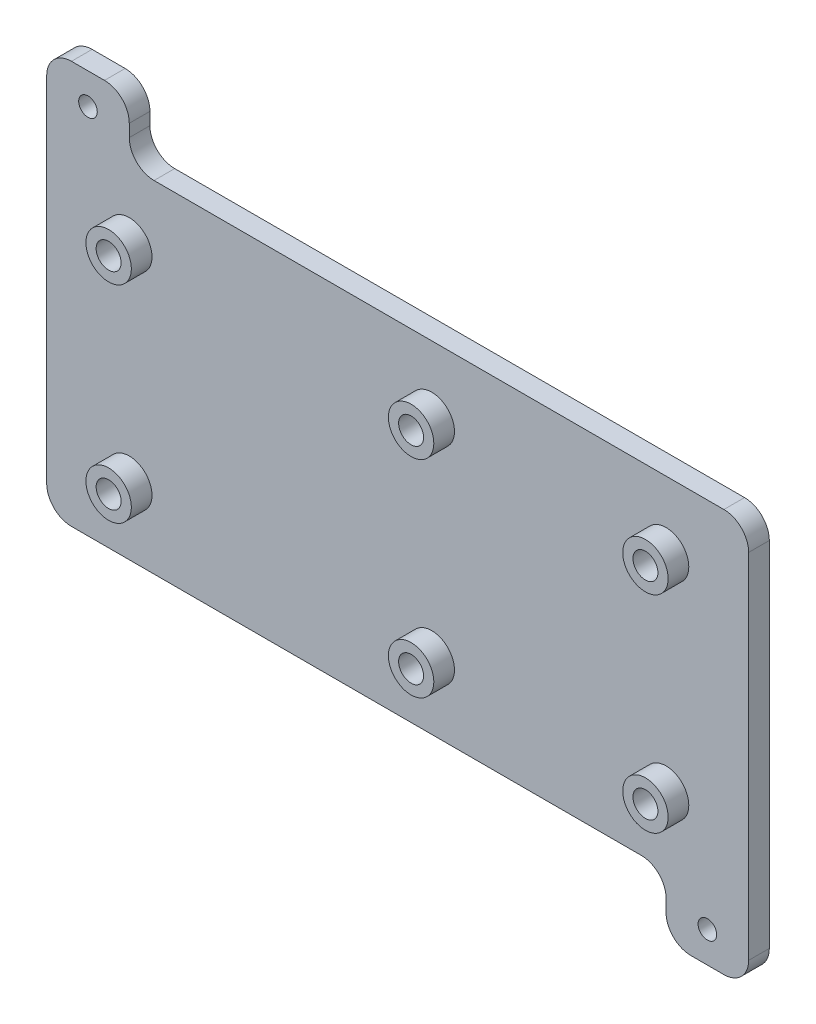
ISO-10303-21;
HEADER;
FILE_DESCRIPTION(('STEP AP214'),'2;1');
FILE_NAME('part.step','',(''),(''),'','','');
FILE_SCHEMA(('AUTOMOTIVE_DESIGN { 1 0 10303 214 1 1 1 1 }'));
ENDSEC;
DATA;
#1=APPLICATION_CONTEXT('core data for automotive mechanical design processes');
#2=APPLICATION_PROTOCOL_DEFINITION('international standard','automotive_design',2000,#1);
#3=PRODUCT_CONTEXT('',#1,'mechanical');
#4=PRODUCT('Part','Part','',(#3));
#5=PRODUCT_RELATED_PRODUCT_CATEGORY('part','',(#4));
#6=PRODUCT_DEFINITION_FORMATION('','',#4);
#7=PRODUCT_DEFINITION_CONTEXT('part definition',#1,'design');
#8=PRODUCT_DEFINITION('design','',#6,#7);
#9=PRODUCT_DEFINITION_SHAPE('','',#8);
#10=(LENGTH_UNIT() NAMED_UNIT(*) SI_UNIT(.MILLI.,.METRE.));
#11=(NAMED_UNIT(*) PLANE_ANGLE_UNIT() SI_UNIT($,.RADIAN.));
#12=(NAMED_UNIT(*) SI_UNIT($,.STERADIAN.) SOLID_ANGLE_UNIT());
#13=UNCERTAINTY_MEASURE_WITH_UNIT(LENGTH_MEASURE(1.E-05),#10,'distance_accuracy_value','');
#14=(GEOMETRIC_REPRESENTATION_CONTEXT(3) GLOBAL_UNCERTAINTY_ASSIGNED_CONTEXT((#13)) GLOBAL_UNIT_ASSIGNED_CONTEXT((#10,
#11,#12)) REPRESENTATION_CONTEXT('',''));
#15=CARTESIAN_POINT('',(0.,0.,0.));
#16=DIRECTION('',(0.,0.,1.));
#17=DIRECTION('',(1.,0.,0.));
#18=AXIS2_PLACEMENT_3D('',#15,#16,#17);
#19=CARTESIAN_POINT('',(85.,41.275,5.));
#20=DIRECTION('',(-1.,0.,0.));
#21=DIRECTION('',(0.,-1.,0.));
#22=AXIS2_PLACEMENT_3D('',#19,#20,#21);
#23=PLANE('',#22);
#24=DIRECTION('',(0.,1.,0.));
#25=VECTOR('',#24,1.);
#26=CARTESIAN_POINT('',(85.,41.275,5.));
#27=LINE('',#26,#25);
#28=CARTESIAN_POINT('',(85.,-50.275,5.));
#29=VERTEX_POINT('',#28);
#30=CARTESIAN_POINT('',(85.,35.275,5.));
#31=VERTEX_POINT('',#30);
#32=EDGE_CURVE('E179',#29,#31,#27,.T.);
#33=ORIENTED_EDGE('',*,*,#32,.F.);
#34=DIRECTION('',(0.,0.,1.));
#35=VECTOR('',#34,1.);
#36=CARTESIAN_POINT('',(85.,-50.275,5.));
#37=LINE('',#36,#35);
#38=CARTESIAN_POINT('',(85.,-50.275,0.));
#39=VERTEX_POINT('',#38);
#40=EDGE_CURVE('E238',#29,#39,#37,.F.);
#41=ORIENTED_EDGE('',*,*,#40,.T.);
#42=DIRECTION('',(0.,1.,0.));
#43=VECTOR('',#42,1.);
#44=CARTESIAN_POINT('',(85.,41.275,0.));
#45=LINE('',#44,#43);
#46=CARTESIAN_POINT('',(85.,35.275,0.));
#47=VERTEX_POINT('',#46);
#48=EDGE_CURVE('E281',#39,#47,#45,.T.);
#49=ORIENTED_EDGE('',*,*,#48,.T.);
#50=DIRECTION('',(0.,0.,-1.));
#51=VECTOR('',#50,1.);
#52=CARTESIAN_POINT('',(85.,35.275,5.));
#53=LINE('',#52,#51);
#54=EDGE_CURVE('E236',#47,#31,#53,.F.);
#55=ORIENTED_EDGE('',*,*,#54,.T.);
#56=EDGE_LOOP('',(#33,#41,#49,#55));
#57=FACE_BOUND('',#56,.T.);
#58=ADVANCED_FACE('F37',(#57),#23,.F.);
#59=CARTESIAN_POINT('',(-85.,41.275,5.));
#60=DIRECTION('',(0.,-1.,0.));
#61=DIRECTION('',(0.,0.,-1.));
#62=AXIS2_PLACEMENT_3D('',#59,#60,#61);
#63=PLANE('',#62);
#64=DIRECTION('',(-1.,0.,0.));
#65=VECTOR('',#64,1.);
#66=CARTESIAN_POINT('',(-85.,41.275,5.));
#67=LINE('',#66,#65);
#68=CARTESIAN_POINT('',(79.,41.275,5.));
#69=VERTEX_POINT('',#68);
#70=CARTESIAN_POINT('',(-59.,41.275,5.));
#71=VERTEX_POINT('',#70);
#72=EDGE_CURVE('E183',#69,#71,#67,.T.);
#73=ORIENTED_EDGE('',*,*,#72,.F.);
#74=DIRECTION('',(0.,0.,-1.));
#75=VECTOR('',#74,1.);
#76=CARTESIAN_POINT('',(79.,41.275,5.));
#77=LINE('',#76,#75);
#78=CARTESIAN_POINT('',(79.,41.275,0.));
#79=VERTEX_POINT('',#78);
#80=EDGE_CURVE('E243',#69,#79,#77,.T.);
#81=ORIENTED_EDGE('',*,*,#80,.T.);
#82=DIRECTION('',(-1.,0.,0.));
#83=VECTOR('',#82,1.);
#84=CARTESIAN_POINT('',(-85.,41.275,0.));
#85=LINE('',#84,#83);
#86=CARTESIAN_POINT('',(-59.,41.275,0.));
#87=VERTEX_POINT('',#86);
#88=EDGE_CURVE('E185',#79,#87,#85,.T.);
#89=ORIENTED_EDGE('',*,*,#88,.T.);
#90=DIRECTION('',(0.,0.,1.));
#91=VECTOR('',#90,1.);
#92=CARTESIAN_POINT('',(-59.,41.275,5.));
#93=LINE('',#92,#91);
#94=EDGE_CURVE('E240',#87,#71,#93,.T.);
#95=ORIENTED_EDGE('',*,*,#94,.T.);
#96=EDGE_LOOP('',(#73,#81,#89,#95));
#97=FACE_BOUND('',#96,.T.);
#98=ADVANCED_FACE('F280',(#97),#63,.F.);
#99=CARTESIAN_POINT('',(-85.,41.275,5.));
#100=DIRECTION('',(1.,0.,0.));
#101=DIRECTION('',(0.,1.,0.));
#102=AXIS2_PLACEMENT_3D('',#99,#100,#101);
#103=PLANE('',#102);
#104=DIRECTION('',(0.,-1.,0.));
#105=VECTOR('',#104,1.);
#106=CARTESIAN_POINT('',(-85.,41.275,5.));
#107=LINE('',#106,#105);
#108=CARTESIAN_POINT('',(-85.,50.275,5.));
#109=VERTEX_POINT('',#108);
#110=CARTESIAN_POINT('',(-85.,-35.275,5.));
#111=VERTEX_POINT('',#110);
#112=EDGE_CURVE('E287',#109,#111,#107,.T.);
#113=ORIENTED_EDGE('',*,*,#112,.F.);
#114=DIRECTION('',(0.,0.,1.));
#115=VECTOR('',#114,1.);
#116=CARTESIAN_POINT('',(-85.,50.275,5.));
#117=LINE('',#116,#115);
#118=CARTESIAN_POINT('',(-85.,50.275,0.));
#119=VERTEX_POINT('',#118);
#120=EDGE_CURVE('E256',#109,#119,#117,.F.);
#121=ORIENTED_EDGE('',*,*,#120,.T.);
#122=DIRECTION('',(0.,-1.,0.));
#123=VECTOR('',#122,1.);
#124=CARTESIAN_POINT('',(-85.,41.275,0.));
#125=LINE('',#124,#123);
#126=CARTESIAN_POINT('',(-85.,-35.275,0.));
#127=VERTEX_POINT('',#126);
#128=EDGE_CURVE('E180',#119,#127,#125,.T.);
#129=ORIENTED_EDGE('',*,*,#128,.T.);
#130=DIRECTION('',(0.,0.,-1.));
#131=VECTOR('',#130,1.);
#132=CARTESIAN_POINT('',(-85.,-35.275,5.));
#133=LINE('',#132,#131);
#134=EDGE_CURVE('E155',#127,#111,#133,.F.);
#135=ORIENTED_EDGE('',*,*,#134,.T.);
#136=EDGE_LOOP('',(#113,#121,#129,#135));
#137=FACE_BOUND('',#136,.T.);
#138=ADVANCED_FACE('F415',(#137),#103,.F.);
#139=CARTESIAN_POINT('',(-85.,-41.275,5.));
#140=DIRECTION('',(0.,1.,0.));
#141=DIRECTION('',(0.,0.,1.));
#142=AXIS2_PLACEMENT_3D('',#139,#140,#141);
#143=PLANE('',#142);
#144=DIRECTION('',(1.,0.,0.));
#145=VECTOR('',#144,1.);
#146=CARTESIAN_POINT('',(-85.,-41.275,0.));
#147=LINE('',#146,#145);
#148=CARTESIAN_POINT('',(-79.,-41.275,0.));
#149=VERTEX_POINT('',#148);
#150=CARTESIAN_POINT('',(59.,-41.275,0.));
#151=VERTEX_POINT('',#150);
#152=EDGE_CURVE('E167',#149,#151,#147,.T.);
#153=ORIENTED_EDGE('',*,*,#152,.T.);
#154=DIRECTION('',(0.,0.,1.));
#155=VECTOR('',#154,1.);
#156=CARTESIAN_POINT('',(59.,-41.275,5.));
#157=LINE('',#156,#155);
#158=CARTESIAN_POINT('',(59.,-41.275,5.));
#159=VERTEX_POINT('',#158);
#160=EDGE_CURVE('E171',#151,#159,#157,.T.);
#161=ORIENTED_EDGE('',*,*,#160,.T.);
#162=DIRECTION('',(1.,0.,0.));
#163=VECTOR('',#162,1.);
#164=CARTESIAN_POINT('',(-85.,-41.275,5.));
#165=LINE('',#164,#163);
#166=CARTESIAN_POINT('',(-79.,-41.275,5.));
#167=VERTEX_POINT('',#166);
#168=EDGE_CURVE('E170',#167,#159,#165,.T.);
#169=ORIENTED_EDGE('',*,*,#168,.F.);
#170=DIRECTION('',(0.,0.,-1.));
#171=VECTOR('',#170,1.);
#172=CARTESIAN_POINT('',(-79.,-41.275,5.));
#173=LINE('',#172,#171);
#174=EDGE_CURVE('E154',#167,#149,#173,.T.);
#175=ORIENTED_EDGE('',*,*,#174,.T.);
#176=EDGE_LOOP('',(#153,#161,#169,#175));
#177=FACE_BOUND('',#176,.T.);
#178=ADVANCED_FACE('F165',(#177),#143,.F.);
#179=CARTESIAN_POINT('',(0.,0.,5.));
#180=DIRECTION('',(0.,0.,1.));
#181=DIRECTION('',(1.,0.,0.));
#182=AXIS2_PLACEMENT_3D('',#179,#180,#181);
#183=PLANE('',#182);
#184=CARTESIAN_POINT('',(-75.,48.775,5.));
#185=DIRECTION('',(0.,0.,1.));
#186=DIRECTION('',(1.,0.,0.));
#187=AXIS2_PLACEMENT_3D('',#184,#185,#186);
#188=CIRCLE('',#187,2.24999999999999);
#189=CARTESIAN_POINT('',(-72.75,48.775,5.));
#190=VERTEX_POINT('',#189);
#191=EDGE_CURVE('E369',#190,#190,#188,.T.);
#192=ORIENTED_EDGE('',*,*,#191,.F.);
#193=EDGE_LOOP('',(#192));
#194=FACE_BOUND('',#193,.T.);
#195=CARTESIAN_POINT('',(75.,-48.775,5.));
#196=DIRECTION('',(0.,0.,1.));
#197=DIRECTION('',(1.,0.,0.));
#198=AXIS2_PLACEMENT_3D('',#195,#196,#197);
#199=CIRCLE('',#198,2.24999999999999);
#200=CARTESIAN_POINT('',(77.25,-48.775,5.));
#201=VERTEX_POINT('',#200);
#202=EDGE_CURVE('E363',#201,#201,#199,.T.);
#203=ORIENTED_EDGE('',*,*,#202,.F.);
#204=EDGE_LOOP('',(#203));
#205=FACE_BOUND('',#204,.T.);
#206=CARTESIAN_POINT('',(65.0000000000003,-25.,5.));
#207=DIRECTION('',(0.,0.,1.));
#208=DIRECTION('',(1.,0.,0.));
#209=AXIS2_PLACEMENT_3D('',#206,#207,#208);
#210=CIRCLE('',#209,5.49999999999954);
#211=CARTESIAN_POINT('',(70.4999999999999,-25.,5.));
#212=VERTEX_POINT('',#211);
#213=EDGE_CURVE('E336',#212,#212,#210,.T.);
#214=ORIENTED_EDGE('',*,*,#213,.F.);
#215=EDGE_LOOP('',(#214));
#216=FACE_BOUND('',#215,.T.);
#217=CARTESIAN_POINT('',(8.25000000000034,-25.,5.));
#218=DIRECTION('',(0.,0.,1.));
#219=DIRECTION('',(1.,0.,0.));
#220=AXIS2_PLACEMENT_3D('',#217,#218,#219);
#221=CIRCLE('',#220,5.49999999999953);
#222=CARTESIAN_POINT('',(13.7499999999999,-25.,5.));
#223=VERTEX_POINT('',#222);
#224=EDGE_CURVE('E327',#223,#223,#221,.T.);
#225=ORIENTED_EDGE('',*,*,#224,.F.);
#226=EDGE_LOOP('',(#225));
#227=FACE_BOUND('',#226,.T.);
#228=CARTESIAN_POINT('',(-64.9999999999997,-25.,5.));
#229=DIRECTION('',(0.,0.,1.));
#230=DIRECTION('',(1.,0.,0.));
#231=AXIS2_PLACEMENT_3D('',#228,#229,#230);
#232=CIRCLE('',#231,5.49999999999953);
#233=CARTESIAN_POINT('',(-59.5000000000002,-25.,5.));
#234=VERTEX_POINT('',#233);
#235=EDGE_CURVE('E318',#234,#234,#232,.T.);
#236=ORIENTED_EDGE('',*,*,#235,.F.);
#237=EDGE_LOOP('',(#236));
#238=FACE_BOUND('',#237,.T.);
#239=CARTESIAN_POINT('',(-64.9999999999997,25.,5.));
#240=DIRECTION('',(0.,0.,1.));
#241=DIRECTION('',(1.,0.,0.));
#242=AXIS2_PLACEMENT_3D('',#239,#240,#241);
#243=CIRCLE('',#242,5.49999999999952);
#244=CARTESIAN_POINT('',(-59.5000000000002,25.,5.));
#245=VERTEX_POINT('',#244);
#246=EDGE_CURVE('E309',#245,#245,#243,.T.);
#247=ORIENTED_EDGE('',*,*,#246,.F.);
#248=EDGE_LOOP('',(#247));
#249=FACE_BOUND('',#248,.T.);
#250=CARTESIAN_POINT('',(8.2500000000003,25.,5.));
#251=DIRECTION('',(0.,0.,1.));
#252=DIRECTION('',(1.,0.,0.));
#253=AXIS2_PLACEMENT_3D('',#250,#251,#252);
#254=CIRCLE('',#253,5.49999999999953);
#255=CARTESIAN_POINT('',(13.7499999999998,25.,5.));
#256=VERTEX_POINT('',#255);
#257=EDGE_CURVE('E300',#256,#256,#254,.T.);
#258=ORIENTED_EDGE('',*,*,#257,.F.);
#259=EDGE_LOOP('',(#258));
#260=FACE_BOUND('',#259,.T.);
#261=CARTESIAN_POINT('',(65.0000000000003,25.,5.));
#262=DIRECTION('',(0.,0.,1.));
#263=DIRECTION('',(1.,0.,0.));
#264=AXIS2_PLACEMENT_3D('',#261,#262,#263);
#265=CIRCLE('',#264,5.49999999999954);
#266=CARTESIAN_POINT('',(70.4999999999998,25.,5.));
#267=VERTEX_POINT('',#266);
#268=EDGE_CURVE('E291',#267,#267,#265,.T.);
#269=ORIENTED_EDGE('',*,*,#268,.F.);
#270=EDGE_LOOP('',(#269));
#271=FACE_BOUND('',#270,.T.);
#272=DIRECTION('',(0.,-1.,0.));
#273=VECTOR('',#272,1.);
#274=CARTESIAN_POINT('',(65.,0.,5.));
#275=LINE('',#274,#273);
#276=CARTESIAN_POINT('',(65.,-47.275,5.));
#277=VERTEX_POINT('',#276);
#278=CARTESIAN_POINT('',(65.,-50.275,5.));
#279=VERTEX_POINT('',#278);
#280=EDGE_CURVE('E355',#277,#279,#275,.T.);
#281=ORIENTED_EDGE('',*,*,#280,.T.);
#282=CARTESIAN_POINT('',(71.,-50.275,5.));
#283=DIRECTION('',(0.,0.,1.));
#284=DIRECTION('',(1.,0.,0.));
#285=AXIS2_PLACEMENT_3D('',#282,#283,#284);
#286=CIRCLE('',#285,6.);
#287=CARTESIAN_POINT('',(71.,-56.275,5.));
#288=VERTEX_POINT('',#287);
#289=EDGE_CURVE('E222',#279,#288,#286,.T.);
#290=ORIENTED_EDGE('',*,*,#289,.T.);
#291=DIRECTION('',(-1.,0.,0.));
#292=VECTOR('',#291,1.);
#293=CARTESIAN_POINT('',(0.,-56.275,5.));
#294=LINE('',#293,#292);
#295=CARTESIAN_POINT('',(79.,-56.275,5.));
#296=VERTEX_POINT('',#295);
#297=EDGE_CURVE('E351',#296,#288,#294,.T.);
#298=ORIENTED_EDGE('',*,*,#297,.F.);
#299=CARTESIAN_POINT('',(79.,-50.275,5.));
#300=DIRECTION('',(0.,0.,1.));
#301=DIRECTION('',(1.,0.,0.));
#302=AXIS2_PLACEMENT_3D('',#299,#300,#301);
#303=CIRCLE('',#302,6.);
#304=EDGE_CURVE('E220',#296,#29,#303,.T.);
#305=ORIENTED_EDGE('',*,*,#304,.T.);
#306=ORIENTED_EDGE('',*,*,#32,.T.);
#307=CARTESIAN_POINT('',(79.,35.275,5.));
#308=DIRECTION('',(0.,0.,1.));
#309=DIRECTION('',(1.,0.,0.));
#310=AXIS2_PLACEMENT_3D('',#307,#308,#309);
#311=CIRCLE('',#310,6.);
#312=EDGE_CURVE('E218',#31,#69,#311,.T.);
#313=ORIENTED_EDGE('',*,*,#312,.T.);
#314=ORIENTED_EDGE('',*,*,#72,.T.);
#315=CARTESIAN_POINT('',(-59.,47.275,5.));
#316=DIRECTION('',(0.,0.,1.));
#317=DIRECTION('',(1.,0.,0.));
#318=AXIS2_PLACEMENT_3D('',#315,#316,#317);
#319=CIRCLE('',#318,6.);
#320=CARTESIAN_POINT('',(-65.,47.275,5.));
#321=VERTEX_POINT('',#320);
#322=EDGE_CURVE('E45',#71,#321,#319,.F.);
#323=ORIENTED_EDGE('',*,*,#322,.T.);
#324=DIRECTION('',(0.,1.,0.));
#325=VECTOR('',#324,1.);
#326=CARTESIAN_POINT('',(-65.,0.,5.));
#327=LINE('',#326,#325);
#328=CARTESIAN_POINT('',(-65.,50.275,5.));
#329=VERTEX_POINT('',#328);
#330=EDGE_CURVE('E266',#321,#329,#327,.T.);
#331=ORIENTED_EDGE('',*,*,#330,.T.);
#332=CARTESIAN_POINT('',(-71.,50.275,5.));
#333=DIRECTION('',(0.,0.,1.));
#334=DIRECTION('',(1.,0.,0.));
#335=AXIS2_PLACEMENT_3D('',#332,#333,#334);
#336=CIRCLE('',#335,6.);
#337=CARTESIAN_POINT('',(-71.,56.275,5.));
#338=VERTEX_POINT('',#337);
#339=EDGE_CURVE('E216',#329,#338,#336,.T.);
#340=ORIENTED_EDGE('',*,*,#339,.T.);
#341=DIRECTION('',(1.,0.,0.));
#342=VECTOR('',#341,1.);
#343=CARTESIAN_POINT('',(0.,56.275,5.));
#344=LINE('',#343,#342);
#345=CARTESIAN_POINT('',(-79.,56.275,5.));
#346=VERTEX_POINT('',#345);
#347=EDGE_CURVE('E275',#346,#338,#344,.T.);
#348=ORIENTED_EDGE('',*,*,#347,.F.);
#349=CARTESIAN_POINT('',(-79.,50.275,5.));
#350=DIRECTION('',(0.,0.,1.));
#351=DIRECTION('',(1.,0.,0.));
#352=AXIS2_PLACEMENT_3D('',#349,#350,#351);
#353=CIRCLE('',#352,6.);
#354=EDGE_CURVE('E214',#346,#109,#353,.T.);
#355=ORIENTED_EDGE('',*,*,#354,.T.);
#356=ORIENTED_EDGE('',*,*,#112,.T.);
#357=CARTESIAN_POINT('',(-79.,-35.275,5.));
#358=DIRECTION('',(0.,0.,1.));
#359=DIRECTION('',(1.,0.,0.));
#360=AXIS2_PLACEMENT_3D('',#357,#358,#359);
#361=CIRCLE('',#360,6.);
#362=EDGE_CURVE('E212',#111,#167,#361,.T.);
#363=ORIENTED_EDGE('',*,*,#362,.T.);
#364=ORIENTED_EDGE('',*,*,#168,.T.);
#365=CARTESIAN_POINT('',(59.,-47.275,5.));
#366=DIRECTION('',(0.,0.,1.));
#367=DIRECTION('',(1.,0.,0.));
#368=AXIS2_PLACEMENT_3D('',#365,#366,#367);
#369=CIRCLE('',#368,6.);
#370=EDGE_CURVE('E258',#159,#277,#369,.F.);
#371=ORIENTED_EDGE('',*,*,#370,.T.);
#372=EDGE_LOOP('',(#281,#290,#298,#305,#306,#313,#314,#323,#331,#340,#348,#355,#356,#363,#364,#371));
#373=FACE_BOUND('',#372,.T.);
#374=ADVANCED_FACE('F265',(#194,#205,#216,#227,#238,#249,#260,#271,#373),#183,.T.);
#375=CARTESIAN_POINT('',(0.,0.,0.));
#376=DIRECTION('',(0.,0.,1.));
#377=DIRECTION('',(1.,0.,0.));
#378=AXIS2_PLACEMENT_3D('',#375,#376,#377);
#379=PLANE('',#378);
#380=CARTESIAN_POINT('',(-75.,48.775,0.));
#381=DIRECTION('',(0.,0.,1.));
#382=DIRECTION('',(1.,0.,0.));
#383=AXIS2_PLACEMENT_3D('',#380,#381,#382);
#384=CIRCLE('',#383,2.24999999999999);
#385=CARTESIAN_POINT('',(-72.75,48.775,0.));
#386=VERTEX_POINT('',#385);
#387=EDGE_CURVE('E366',#386,#386,#384,.T.);
#388=ORIENTED_EDGE('',*,*,#387,.T.);
#389=EDGE_LOOP('',(#388));
#390=FACE_BOUND('',#389,.T.);
#391=CARTESIAN_POINT('',(75.,-48.775,0.));
#392=DIRECTION('',(0.,0.,1.));
#393=DIRECTION('',(1.,0.,0.));
#394=AXIS2_PLACEMENT_3D('',#391,#392,#393);
#395=CIRCLE('',#394,2.24999999999999);
#396=CARTESIAN_POINT('',(77.25,-48.775,0.));
#397=VERTEX_POINT('',#396);
#398=EDGE_CURVE('E357',#397,#397,#395,.T.);
#399=ORIENTED_EDGE('',*,*,#398,.T.);
#400=EDGE_LOOP('',(#399));
#401=FACE_BOUND('',#400,.T.);
#402=DIRECTION('',(-1.,0.,0.));
#403=VECTOR('',#402,1.);
#404=CARTESIAN_POINT('',(0.,-56.275,0.));
#405=LINE('',#404,#403);
#406=CARTESIAN_POINT('',(79.,-56.275,0.));
#407=VERTEX_POINT('',#406);
#408=CARTESIAN_POINT('',(71.,-56.275,0.));
#409=VERTEX_POINT('',#408);
#410=EDGE_CURVE('E276',#407,#409,#405,.T.);
#411=ORIENTED_EDGE('',*,*,#410,.T.);
#412=CARTESIAN_POINT('',(71.,-50.275,0.));
#413=DIRECTION('',(0.,0.,1.));
#414=DIRECTION('',(1.,0.,0.));
#415=AXIS2_PLACEMENT_3D('',#412,#413,#414);
#416=CIRCLE('',#415,6.);
#417=CARTESIAN_POINT('',(65.,-50.275,0.));
#418=VERTEX_POINT('',#417);
#419=EDGE_CURVE('E234',#409,#418,#416,.F.);
#420=ORIENTED_EDGE('',*,*,#419,.T.);
#421=DIRECTION('',(0.,-1.,0.));
#422=VECTOR('',#421,1.);
#423=CARTESIAN_POINT('',(65.,0.,0.));
#424=LINE('',#423,#422);
#425=CARTESIAN_POINT('',(65.,-47.275,0.));
#426=VERTEX_POINT('',#425);
#427=EDGE_CURVE('E354',#426,#418,#424,.T.);
#428=ORIENTED_EDGE('',*,*,#427,.F.);
#429=CARTESIAN_POINT('',(59.,-47.275,0.));
#430=DIRECTION('',(0.,0.,1.));
#431=DIRECTION('',(1.,0.,0.));
#432=AXIS2_PLACEMENT_3D('',#429,#430,#431);
#433=CIRCLE('',#432,6.);
#434=EDGE_CURVE('E178',#426,#151,#433,.T.);
#435=ORIENTED_EDGE('',*,*,#434,.T.);
#436=ORIENTED_EDGE('',*,*,#152,.F.);
#437=CARTESIAN_POINT('',(-79.,-35.275,0.));
#438=DIRECTION('',(0.,0.,1.));
#439=DIRECTION('',(1.,0.,0.));
#440=AXIS2_PLACEMENT_3D('',#437,#438,#439);
#441=CIRCLE('',#440,6.);
#442=EDGE_CURVE('E151',#149,#127,#441,.F.);
#443=ORIENTED_EDGE('',*,*,#442,.T.);
#444=ORIENTED_EDGE('',*,*,#128,.F.);
#445=CARTESIAN_POINT('',(-79.,50.275,0.));
#446=DIRECTION('',(0.,0.,1.));
#447=DIRECTION('',(1.,0.,0.));
#448=AXIS2_PLACEMENT_3D('',#445,#446,#447);
#449=CIRCLE('',#448,6.);
#450=CARTESIAN_POINT('',(-79.,56.275,0.));
#451=VERTEX_POINT('',#450);
#452=EDGE_CURVE('E159',#119,#451,#449,.F.);
#453=ORIENTED_EDGE('',*,*,#452,.T.);
#454=DIRECTION('',(1.,0.,0.));
#455=VECTOR('',#454,1.);
#456=CARTESIAN_POINT('',(0.,56.275,0.));
#457=LINE('',#456,#455);
#458=CARTESIAN_POINT('',(-71.,56.275,0.));
#459=VERTEX_POINT('',#458);
#460=EDGE_CURVE('E344',#451,#459,#457,.T.);
#461=ORIENTED_EDGE('',*,*,#460,.T.);
#462=CARTESIAN_POINT('',(-71.,50.275,0.));
#463=DIRECTION('',(0.,0.,1.));
#464=DIRECTION('',(1.,0.,0.));
#465=AXIS2_PLACEMENT_3D('',#462,#463,#464);
#466=CIRCLE('',#465,6.);
#467=CARTESIAN_POINT('',(-65.,50.275,0.));
#468=VERTEX_POINT('',#467);
#469=EDGE_CURVE('E229',#459,#468,#466,.F.);
#470=ORIENTED_EDGE('',*,*,#469,.T.);
#471=DIRECTION('',(0.,1.,0.));
#472=VECTOR('',#471,1.);
#473=CARTESIAN_POINT('',(-65.,0.,0.));
#474=LINE('',#473,#472);
#475=CARTESIAN_POINT('',(-65.,47.275,0.));
#476=VERTEX_POINT('',#475);
#477=EDGE_CURVE('E346',#476,#468,#474,.T.);
#478=ORIENTED_EDGE('',*,*,#477,.F.);
#479=CARTESIAN_POINT('',(-59.,47.275,0.));
#480=DIRECTION('',(0.,0.,1.));
#481=DIRECTION('',(1.,0.,0.));
#482=AXIS2_PLACEMENT_3D('',#479,#480,#481);
#483=CIRCLE('',#482,6.);
#484=EDGE_CURVE('E11',#476,#87,#483,.T.);
#485=ORIENTED_EDGE('',*,*,#484,.T.);
#486=ORIENTED_EDGE('',*,*,#88,.F.);
#487=CARTESIAN_POINT('',(79.,35.275,0.));
#488=DIRECTION('',(0.,0.,1.));
#489=DIRECTION('',(1.,0.,0.));
#490=AXIS2_PLACEMENT_3D('',#487,#488,#489);
#491=CIRCLE('',#490,6.);
#492=EDGE_CURVE('E58',#79,#47,#491,.F.);
#493=ORIENTED_EDGE('',*,*,#492,.T.);
#494=ORIENTED_EDGE('',*,*,#48,.F.);
#495=CARTESIAN_POINT('',(79.,-50.275,0.));
#496=DIRECTION('',(0.,0.,1.));
#497=DIRECTION('',(1.,0.,0.));
#498=AXIS2_PLACEMENT_3D('',#495,#496,#497);
#499=CIRCLE('',#498,6.);
#500=EDGE_CURVE('E232',#39,#407,#499,.F.);
#501=ORIENTED_EDGE('',*,*,#500,.T.);
#502=EDGE_LOOP('',(#411,#420,#428,#435,#436,#443,#444,#453,#461,#470,#478,#485,#486,#493,#494,#501));
#503=FACE_BOUND('',#502,.T.);
#504=ADVANCED_FACE('F175',(#390,#401,#503),#379,.F.);
#505=CARTESIAN_POINT('',(65.0000000000003,25.,10.));
#506=DIRECTION('',(0.,0.,1.));
#507=DIRECTION('',(1.,0.,0.));
#508=AXIS2_PLACEMENT_3D('',#505,#506,#507);
#509=PLANE('',#508);
#510=CARTESIAN_POINT('',(65.0000000000003,25.,10.));
#511=DIRECTION('',(0.,0.,1.));
#512=DIRECTION('',(1.,0.,0.));
#513=AXIS2_PLACEMENT_3D('',#510,#511,#512);
#514=CIRCLE('',#513,5.49999999999954);
#515=CARTESIAN_POINT('',(70.4999999999998,25.,10.));
#516=VERTEX_POINT('',#515);
#517=EDGE_CURVE('E283',#516,#516,#514,.T.);
#518=ORIENTED_EDGE('',*,*,#517,.T.);
#519=EDGE_LOOP('',(#518));
#520=FACE_BOUND('',#519,.T.);
#521=CARTESIAN_POINT('',(65.0000000000003,25.,10.));
#522=DIRECTION('',(0.,0.,1.));
#523=DIRECTION('',(1.,0.,0.));
#524=AXIS2_PLACEMENT_3D('',#521,#522,#523);
#525=CIRCLE('',#524,3.02499999999954);
#526=CARTESIAN_POINT('',(68.0249999999998,25.,10.));
#527=VERTEX_POINT('',#526);
#528=EDGE_CURVE('E294',#527,#527,#525,.T.);
#529=ORIENTED_EDGE('',*,*,#528,.F.);
#530=EDGE_LOOP('',(#529));
#531=FACE_BOUND('',#530,.T.);
#532=ADVANCED_FACE('F397',(#520,#531),#509,.T.);
#533=CARTESIAN_POINT('',(65.0000000000003,25.,10.));
#534=DIRECTION('',(0.,0.,-1.));
#535=DIRECTION('',(-1.,0.,0.));
#536=AXIS2_PLACEMENT_3D('',#533,#534,#535);
#537=CYLINDRICAL_SURFACE('',#536,5.49999999999954);
#538=ORIENTED_EDGE('',*,*,#517,.F.);
#539=EDGE_LOOP('',(#538));
#540=FACE_BOUND('',#539,.T.);
#541=ORIENTED_EDGE('',*,*,#268,.T.);
#542=EDGE_LOOP('',(#541));
#543=FACE_BOUND('',#542,.T.);
#544=ADVANCED_FACE('F394',(#540,#543),#537,.T.);
#545=CARTESIAN_POINT('',(65.0000000000003,25.,10.));
#546=DIRECTION('',(0.,0.,-1.));
#547=DIRECTION('',(-1.,0.,0.));
#548=AXIS2_PLACEMENT_3D('',#545,#546,#547);
#549=CYLINDRICAL_SURFACE('',#548,3.02499999999954);
#550=ORIENTED_EDGE('',*,*,#528,.T.);
#551=EDGE_LOOP('',(#550));
#552=FACE_BOUND('',#551,.T.);
#553=CARTESIAN_POINT('',(65.0000000000003,25.,5.));
#554=DIRECTION('',(0.,0.,1.));
#555=DIRECTION('',(1.,0.,0.));
#556=AXIS2_PLACEMENT_3D('',#553,#554,#555);
#557=CIRCLE('',#556,3.02499999999954);
#558=CARTESIAN_POINT('',(68.0249999999998,25.,5.));
#559=VERTEX_POINT('',#558);
#560=EDGE_CURVE('E189',#559,#559,#557,.F.);
#561=ORIENTED_EDGE('',*,*,#560,.T.);
#562=EDGE_LOOP('',(#561));
#563=FACE_BOUND('',#562,.T.);
#564=ADVANCED_FACE('F396',(#552,#563),#549,.F.);
#565=ORIENTED_EDGE('',*,*,#560,.F.);
#566=EDGE_LOOP('',(#565));
#567=FACE_BOUND('',#566,.T.);
#568=ADVANCED_FACE('F379',(#567),#183,.T.);
#569=CARTESIAN_POINT('',(8.2500000000003,25.,10.));
#570=DIRECTION('',(0.,0.,1.));
#571=DIRECTION('',(1.,0.,0.));
#572=AXIS2_PLACEMENT_3D('',#569,#570,#571);
#573=PLANE('',#572);
#574=CARTESIAN_POINT('',(8.2500000000003,25.,10.));
#575=DIRECTION('',(0.,0.,1.));
#576=DIRECTION('',(1.,0.,0.));
#577=AXIS2_PLACEMENT_3D('',#574,#575,#576);
#578=CIRCLE('',#577,5.49999999999953);
#579=CARTESIAN_POINT('',(13.7499999999998,25.,10.));
#580=VERTEX_POINT('',#579);
#581=EDGE_CURVE('E299',#580,#580,#578,.T.);
#582=ORIENTED_EDGE('',*,*,#581,.T.);
#583=EDGE_LOOP('',(#582));
#584=FACE_BOUND('',#583,.T.);
#585=CARTESIAN_POINT('',(8.2500000000003,25.,10.));
#586=DIRECTION('',(0.,0.,1.));
#587=DIRECTION('',(1.,0.,0.));
#588=AXIS2_PLACEMENT_3D('',#585,#586,#587);
#589=CIRCLE('',#588,3.02499999999953);
#590=CARTESIAN_POINT('',(11.2749999999998,25.,10.));
#591=VERTEX_POINT('',#590);
#592=EDGE_CURVE('E303',#591,#591,#589,.T.);
#593=ORIENTED_EDGE('',*,*,#592,.F.);
#594=EDGE_LOOP('',(#593));
#595=FACE_BOUND('',#594,.T.);
#596=ADVANCED_FACE('F550',(#584,#595),#573,.T.);
#597=CARTESIAN_POINT('',(8.2500000000003,25.,10.));
#598=DIRECTION('',(0.,0.,-1.));
#599=DIRECTION('',(-1.,0.,0.));
#600=AXIS2_PLACEMENT_3D('',#597,#598,#599);
#601=CYLINDRICAL_SURFACE('',#600,5.49999999999953);
#602=ORIENTED_EDGE('',*,*,#581,.F.);
#603=EDGE_LOOP('',(#602));
#604=FACE_BOUND('',#603,.T.);
#605=ORIENTED_EDGE('',*,*,#257,.T.);
#606=EDGE_LOOP('',(#605));
#607=FACE_BOUND('',#606,.T.);
#608=ADVANCED_FACE('F548',(#604,#607),#601,.T.);
#609=CARTESIAN_POINT('',(8.2500000000003,25.,10.));
#610=DIRECTION('',(0.,0.,-1.));
#611=DIRECTION('',(-1.,0.,0.));
#612=AXIS2_PLACEMENT_3D('',#609,#610,#611);
#613=CYLINDRICAL_SURFACE('',#612,3.02499999999953);
#614=ORIENTED_EDGE('',*,*,#592,.T.);
#615=EDGE_LOOP('',(#614));
#616=FACE_BOUND('',#615,.T.);
#617=CARTESIAN_POINT('',(8.2500000000003,25.,5.));
#618=DIRECTION('',(0.,0.,1.));
#619=DIRECTION('',(1.,0.,0.));
#620=AXIS2_PLACEMENT_3D('',#617,#618,#619);
#621=CIRCLE('',#620,3.02499999999953);
#622=CARTESIAN_POINT('',(11.2749999999998,25.,5.));
#623=VERTEX_POINT('',#622);
#624=EDGE_CURVE('E192',#623,#623,#621,.F.);
#625=ORIENTED_EDGE('',*,*,#624,.T.);
#626=EDGE_LOOP('',(#625));
#627=FACE_BOUND('',#626,.T.);
#628=ADVANCED_FACE('F545',(#616,#627),#613,.F.);
#629=ORIENTED_EDGE('',*,*,#624,.F.);
#630=EDGE_LOOP('',(#629));
#631=FACE_BOUND('',#630,.T.);
#632=ADVANCED_FACE('F540',(#631),#183,.T.);
#633=CARTESIAN_POINT('',(-64.9999999999997,25.,10.));
#634=DIRECTION('',(0.,0.,1.));
#635=DIRECTION('',(1.,0.,0.));
#636=AXIS2_PLACEMENT_3D('',#633,#634,#635);
#637=PLANE('',#636);
#638=CARTESIAN_POINT('',(-64.9999999999997,25.,10.));
#639=DIRECTION('',(0.,0.,1.));
#640=DIRECTION('',(1.,0.,0.));
#641=AXIS2_PLACEMENT_3D('',#638,#639,#640);
#642=CIRCLE('',#641,5.49999999999952);
#643=CARTESIAN_POINT('',(-59.5000000000002,25.,10.));
#644=VERTEX_POINT('',#643);
#645=EDGE_CURVE('E308',#644,#644,#642,.T.);
#646=ORIENTED_EDGE('',*,*,#645,.T.);
#647=EDGE_LOOP('',(#646));
#648=FACE_BOUND('',#647,.T.);
#649=CARTESIAN_POINT('',(-64.9999999999997,25.,10.));
#650=DIRECTION('',(0.,0.,1.));
#651=DIRECTION('',(1.,0.,0.));
#652=AXIS2_PLACEMENT_3D('',#649,#650,#651);
#653=CIRCLE('',#652,3.02499999999953);
#654=CARTESIAN_POINT('',(-61.9750000000002,25.,10.));
#655=VERTEX_POINT('',#654);
#656=EDGE_CURVE('E312',#655,#655,#653,.T.);
#657=ORIENTED_EDGE('',*,*,#656,.F.);
#658=EDGE_LOOP('',(#657));
#659=FACE_BOUND('',#658,.T.);
#660=ADVANCED_FACE('F537',(#648,#659),#637,.T.);
#661=CARTESIAN_POINT('',(-64.9999999999997,25.,10.));
#662=DIRECTION('',(0.,0.,-1.));
#663=DIRECTION('',(-1.,0.,0.));
#664=AXIS2_PLACEMENT_3D('',#661,#662,#663);
#665=CYLINDRICAL_SURFACE('',#664,5.49999999999952);
#666=ORIENTED_EDGE('',*,*,#645,.F.);
#667=EDGE_LOOP('',(#666));
#668=FACE_BOUND('',#667,.T.);
#669=ORIENTED_EDGE('',*,*,#246,.T.);
#670=EDGE_LOOP('',(#669));
#671=FACE_BOUND('',#670,.T.);
#672=ADVANCED_FACE('F535',(#668,#671),#665,.T.);
#673=CARTESIAN_POINT('',(-64.9999999999997,25.,10.));
#674=DIRECTION('',(0.,0.,-1.));
#675=DIRECTION('',(-1.,0.,0.));
#676=AXIS2_PLACEMENT_3D('',#673,#674,#675);
#677=CYLINDRICAL_SURFACE('',#676,3.02499999999953);
#678=ORIENTED_EDGE('',*,*,#656,.T.);
#679=EDGE_LOOP('',(#678));
#680=FACE_BOUND('',#679,.T.);
#681=CARTESIAN_POINT('',(-64.9999999999997,25.,5.));
#682=DIRECTION('',(0.,0.,1.));
#683=DIRECTION('',(1.,0.,0.));
#684=AXIS2_PLACEMENT_3D('',#681,#682,#683);
#685=CIRCLE('',#684,3.02499999999953);
#686=CARTESIAN_POINT('',(-61.9750000000002,25.,5.));
#687=VERTEX_POINT('',#686);
#688=EDGE_CURVE('E195',#687,#687,#685,.F.);
#689=ORIENTED_EDGE('',*,*,#688,.T.);
#690=EDGE_LOOP('',(#689));
#691=FACE_BOUND('',#690,.T.);
#692=ADVANCED_FACE('F532',(#680,#691),#677,.F.);
#693=ORIENTED_EDGE('',*,*,#688,.F.);
#694=EDGE_LOOP('',(#693));
#695=FACE_BOUND('',#694,.T.);
#696=ADVANCED_FACE('F527',(#695),#183,.T.);
#697=CARTESIAN_POINT('',(-64.9999999999997,-25.,10.));
#698=DIRECTION('',(0.,0.,1.));
#699=DIRECTION('',(1.,0.,0.));
#700=AXIS2_PLACEMENT_3D('',#697,#698,#699);
#701=PLANE('',#700);
#702=CARTESIAN_POINT('',(-64.9999999999997,-25.,10.));
#703=DIRECTION('',(0.,0.,1.));
#704=DIRECTION('',(1.,0.,0.));
#705=AXIS2_PLACEMENT_3D('',#702,#703,#704);
#706=CIRCLE('',#705,5.49999999999953);
#707=CARTESIAN_POINT('',(-59.5000000000002,-25.,10.));
#708=VERTEX_POINT('',#707);
#709=EDGE_CURVE('E317',#708,#708,#706,.T.);
#710=ORIENTED_EDGE('',*,*,#709,.T.);
#711=EDGE_LOOP('',(#710));
#712=FACE_BOUND('',#711,.T.);
#713=CARTESIAN_POINT('',(-64.9999999999997,-25.,10.));
#714=DIRECTION('',(0.,0.,1.));
#715=DIRECTION('',(1.,0.,0.));
#716=AXIS2_PLACEMENT_3D('',#713,#714,#715);
#717=CIRCLE('',#716,3.02499999999954);
#718=CARTESIAN_POINT('',(-61.9750000000002,-25.,10.));
#719=VERTEX_POINT('',#718);
#720=EDGE_CURVE('E321',#719,#719,#717,.T.);
#721=ORIENTED_EDGE('',*,*,#720,.F.);
#722=EDGE_LOOP('',(#721));
#723=FACE_BOUND('',#722,.T.);
#724=ADVANCED_FACE('F524',(#712,#723),#701,.T.);
#725=CARTESIAN_POINT('',(-64.9999999999997,-25.,10.));
#726=DIRECTION('',(0.,0.,-1.));
#727=DIRECTION('',(-1.,0.,0.));
#728=AXIS2_PLACEMENT_3D('',#725,#726,#727);
#729=CYLINDRICAL_SURFACE('',#728,5.49999999999953);
#730=ORIENTED_EDGE('',*,*,#709,.F.);
#731=EDGE_LOOP('',(#730));
#732=FACE_BOUND('',#731,.T.);
#733=ORIENTED_EDGE('',*,*,#235,.T.);
#734=EDGE_LOOP('',(#733));
#735=FACE_BOUND('',#734,.T.);
#736=ADVANCED_FACE('F522',(#732,#735),#729,.T.);
#737=CARTESIAN_POINT('',(-64.9999999999997,-25.,10.));
#738=DIRECTION('',(0.,0.,-1.));
#739=DIRECTION('',(-1.,0.,0.));
#740=AXIS2_PLACEMENT_3D('',#737,#738,#739);
#741=CYLINDRICAL_SURFACE('',#740,3.02499999999954);
#742=ORIENTED_EDGE('',*,*,#720,.T.);
#743=EDGE_LOOP('',(#742));
#744=FACE_BOUND('',#743,.T.);
#745=CARTESIAN_POINT('',(-64.9999999999997,-25.,5.));
#746=DIRECTION('',(0.,0.,1.));
#747=DIRECTION('',(1.,0.,0.));
#748=AXIS2_PLACEMENT_3D('',#745,#746,#747);
#749=CIRCLE('',#748,3.02499999999954);
#750=CARTESIAN_POINT('',(-61.9750000000002,-25.,5.));
#751=VERTEX_POINT('',#750);
#752=EDGE_CURVE('E198',#751,#751,#749,.F.);
#753=ORIENTED_EDGE('',*,*,#752,.T.);
#754=EDGE_LOOP('',(#753));
#755=FACE_BOUND('',#754,.T.);
#756=ADVANCED_FACE('F519',(#744,#755),#741,.F.);
#757=ORIENTED_EDGE('',*,*,#752,.F.);
#758=EDGE_LOOP('',(#757));
#759=FACE_BOUND('',#758,.T.);
#760=ADVANCED_FACE('F514',(#759),#183,.T.);
#761=CARTESIAN_POINT('',(8.25000000000034,-25.,10.));
#762=DIRECTION('',(0.,0.,1.));
#763=DIRECTION('',(1.,0.,0.));
#764=AXIS2_PLACEMENT_3D('',#761,#762,#763);
#765=PLANE('',#764);
#766=CARTESIAN_POINT('',(8.25000000000034,-25.,10.));
#767=DIRECTION('',(0.,0.,1.));
#768=DIRECTION('',(1.,0.,0.));
#769=AXIS2_PLACEMENT_3D('',#766,#767,#768);
#770=CIRCLE('',#769,5.49999999999953);
#771=CARTESIAN_POINT('',(13.7499999999999,-25.,10.));
#772=VERTEX_POINT('',#771);
#773=EDGE_CURVE('E326',#772,#772,#770,.T.);
#774=ORIENTED_EDGE('',*,*,#773,.T.);
#775=EDGE_LOOP('',(#774));
#776=FACE_BOUND('',#775,.T.);
#777=CARTESIAN_POINT('',(8.25000000000034,-25.,10.));
#778=DIRECTION('',(0.,0.,1.));
#779=DIRECTION('',(1.,0.,0.));
#780=AXIS2_PLACEMENT_3D('',#777,#778,#779);
#781=CIRCLE('',#780,3.02499999999953);
#782=CARTESIAN_POINT('',(11.2749999999999,-25.,10.));
#783=VERTEX_POINT('',#782);
#784=EDGE_CURVE('E330',#783,#783,#781,.T.);
#785=ORIENTED_EDGE('',*,*,#784,.F.);
#786=EDGE_LOOP('',(#785));
#787=FACE_BOUND('',#786,.T.);
#788=ADVANCED_FACE('F511',(#776,#787),#765,.T.);
#789=CARTESIAN_POINT('',(8.25000000000034,-25.,10.));
#790=DIRECTION('',(0.,0.,-1.));
#791=DIRECTION('',(-1.,0.,0.));
#792=AXIS2_PLACEMENT_3D('',#789,#790,#791);
#793=CYLINDRICAL_SURFACE('',#792,5.49999999999953);
#794=ORIENTED_EDGE('',*,*,#773,.F.);
#795=EDGE_LOOP('',(#794));
#796=FACE_BOUND('',#795,.T.);
#797=ORIENTED_EDGE('',*,*,#224,.T.);
#798=EDGE_LOOP('',(#797));
#799=FACE_BOUND('',#798,.T.);
#800=ADVANCED_FACE('F509',(#796,#799),#793,.T.);
#801=CARTESIAN_POINT('',(8.25000000000034,-25.,10.));
#802=DIRECTION('',(0.,0.,-1.));
#803=DIRECTION('',(-1.,0.,0.));
#804=AXIS2_PLACEMENT_3D('',#801,#802,#803);
#805=CYLINDRICAL_SURFACE('',#804,3.02499999999953);
#806=ORIENTED_EDGE('',*,*,#784,.T.);
#807=EDGE_LOOP('',(#806));
#808=FACE_BOUND('',#807,.T.);
#809=CARTESIAN_POINT('',(8.25000000000034,-25.,5.));
#810=DIRECTION('',(0.,0.,1.));
#811=DIRECTION('',(1.,0.,0.));
#812=AXIS2_PLACEMENT_3D('',#809,#810,#811);
#813=CIRCLE('',#812,3.02499999999953);
#814=CARTESIAN_POINT('',(11.2749999999999,-25.,5.));
#815=VERTEX_POINT('',#814);
#816=EDGE_CURVE('E201',#815,#815,#813,.F.);
#817=ORIENTED_EDGE('',*,*,#816,.T.);
#818=EDGE_LOOP('',(#817));
#819=FACE_BOUND('',#818,.T.);
#820=ADVANCED_FACE('F506',(#808,#819),#805,.F.);
#821=ORIENTED_EDGE('',*,*,#816,.F.);
#822=EDGE_LOOP('',(#821));
#823=FACE_BOUND('',#822,.T.);
#824=ADVANCED_FACE('F501',(#823),#183,.T.);
#825=CARTESIAN_POINT('',(65.0000000000003,-25.,10.));
#826=DIRECTION('',(0.,0.,1.));
#827=DIRECTION('',(1.,0.,0.));
#828=AXIS2_PLACEMENT_3D('',#825,#826,#827);
#829=PLANE('',#828);
#830=CARTESIAN_POINT('',(65.0000000000003,-25.,10.));
#831=DIRECTION('',(0.,0.,1.));
#832=DIRECTION('',(1.,0.,0.));
#833=AXIS2_PLACEMENT_3D('',#830,#831,#832);
#834=CIRCLE('',#833,5.49999999999954);
#835=CARTESIAN_POINT('',(70.4999999999999,-25.,10.));
#836=VERTEX_POINT('',#835);
#837=EDGE_CURVE('E335',#836,#836,#834,.T.);
#838=ORIENTED_EDGE('',*,*,#837,.T.);
#839=EDGE_LOOP('',(#838));
#840=FACE_BOUND('',#839,.T.);
#841=CARTESIAN_POINT('',(65.0000000000003,-25.,10.));
#842=DIRECTION('',(0.,0.,1.));
#843=DIRECTION('',(1.,0.,0.));
#844=AXIS2_PLACEMENT_3D('',#841,#842,#843);
#845=CIRCLE('',#844,3.02499999999954);
#846=CARTESIAN_POINT('',(68.0249999999998,-25.,10.));
#847=VERTEX_POINT('',#846);
#848=EDGE_CURVE('E339',#847,#847,#845,.T.);
#849=ORIENTED_EDGE('',*,*,#848,.F.);
#850=EDGE_LOOP('',(#849));
#851=FACE_BOUND('',#850,.T.);
#852=ADVANCED_FACE('F498',(#840,#851),#829,.T.);
#853=CARTESIAN_POINT('',(65.0000000000003,-25.,10.));
#854=DIRECTION('',(0.,0.,-1.));
#855=DIRECTION('',(-1.,0.,0.));
#856=AXIS2_PLACEMENT_3D('',#853,#854,#855);
#857=CYLINDRICAL_SURFACE('',#856,5.49999999999954);
#858=ORIENTED_EDGE('',*,*,#837,.F.);
#859=EDGE_LOOP('',(#858));
#860=FACE_BOUND('',#859,.T.);
#861=ORIENTED_EDGE('',*,*,#213,.T.);
#862=EDGE_LOOP('',(#861));
#863=FACE_BOUND('',#862,.T.);
#864=ADVANCED_FACE('F496',(#860,#863),#857,.T.);
#865=CARTESIAN_POINT('',(65.0000000000003,-25.,10.));
#866=DIRECTION('',(0.,0.,-1.));
#867=DIRECTION('',(-1.,0.,0.));
#868=AXIS2_PLACEMENT_3D('',#865,#866,#867);
#869=CYLINDRICAL_SURFACE('',#868,3.02499999999954);
#870=ORIENTED_EDGE('',*,*,#848,.T.);
#871=EDGE_LOOP('',(#870));
#872=FACE_BOUND('',#871,.T.);
#873=CARTESIAN_POINT('',(65.0000000000003,-25.,5.));
#874=DIRECTION('',(0.,0.,1.));
#875=DIRECTION('',(1.,0.,0.));
#876=AXIS2_PLACEMENT_3D('',#873,#874,#875);
#877=CIRCLE('',#876,3.02499999999954);
#878=CARTESIAN_POINT('',(68.0249999999998,-25.,5.));
#879=VERTEX_POINT('',#878);
#880=EDGE_CURVE('E172',#879,#879,#877,.F.);
#881=ORIENTED_EDGE('',*,*,#880,.T.);
#882=EDGE_LOOP('',(#881));
#883=FACE_BOUND('',#882,.T.);
#884=ADVANCED_FACE('F493',(#872,#883),#869,.F.);
#885=ORIENTED_EDGE('',*,*,#880,.F.);
#886=EDGE_LOOP('',(#885));
#887=FACE_BOUND('',#886,.T.);
#888=ADVANCED_FACE('F378',(#887),#183,.T.);
#889=CARTESIAN_POINT('',(0.,56.275,0.));
#890=DIRECTION('',(0.,-1.,0.));
#891=DIRECTION('',(0.,0.,-1.));
#892=AXIS2_PLACEMENT_3D('',#889,#890,#891);
#893=PLANE('',#892);
#894=ORIENTED_EDGE('',*,*,#347,.T.);
#895=DIRECTION('',(0.,0.,1.));
#896=VECTOR('',#895,1.);
#897=CARTESIAN_POINT('',(-71.,56.275,0.));
#898=LINE('',#897,#896);
#899=EDGE_CURVE('E253',#338,#459,#898,.F.);
#900=ORIENTED_EDGE('',*,*,#899,.T.);
#901=ORIENTED_EDGE('',*,*,#460,.F.);
#902=DIRECTION('',(0.,0.,1.));
#903=VECTOR('',#902,1.);
#904=CARTESIAN_POINT('',(-79.,56.275,0.));
#905=LINE('',#904,#903);
#906=EDGE_CURVE('E250',#451,#346,#905,.T.);
#907=ORIENTED_EDGE('',*,*,#906,.T.);
#908=EDGE_LOOP('',(#894,#900,#901,#907));
#909=FACE_BOUND('',#908,.T.);
#910=ADVANCED_FACE('F454',(#909),#893,.F.);
#911=CARTESIAN_POINT('',(-65.,0.,0.));
#912=DIRECTION('',(1.,0.,0.));
#913=DIRECTION('',(0.,0.,-1.));
#914=AXIS2_PLACEMENT_3D('',#911,#912,#913);
#915=PLANE('',#914);
#916=ORIENTED_EDGE('',*,*,#330,.F.);
#917=DIRECTION('',(0.,0.,1.));
#918=VECTOR('',#917,1.);
#919=CARTESIAN_POINT('',(-65.,47.275,0.));
#920=LINE('',#919,#918);
#921=EDGE_CURVE('E248',#321,#476,#920,.F.);
#922=ORIENTED_EDGE('',*,*,#921,.T.);
#923=ORIENTED_EDGE('',*,*,#477,.T.);
#924=DIRECTION('',(0.,0.,1.));
#925=VECTOR('',#924,1.);
#926=CARTESIAN_POINT('',(-65.,50.275,5.));
#927=LINE('',#926,#925);
#928=EDGE_CURVE('E245',#468,#329,#927,.T.);
#929=ORIENTED_EDGE('',*,*,#928,.T.);
#930=EDGE_LOOP('',(#916,#922,#923,#929));
#931=FACE_BOUND('',#930,.T.);
#932=ADVANCED_FACE('F272',(#931),#915,.T.);
#933=CARTESIAN_POINT('',(65.,0.,0.));
#934=DIRECTION('',(-1.,0.,0.));
#935=DIRECTION('',(0.,0.,1.));
#936=AXIS2_PLACEMENT_3D('',#933,#934,#935);
#937=PLANE('',#936);
#938=ORIENTED_EDGE('',*,*,#280,.F.);
#939=DIRECTION('',(0.,0.,1.));
#940=VECTOR('',#939,1.);
#941=CARTESIAN_POINT('',(65.,-47.275,0.));
#942=LINE('',#941,#940);
#943=EDGE_CURVE('E210',#277,#426,#942,.F.);
#944=ORIENTED_EDGE('',*,*,#943,.T.);
#945=ORIENTED_EDGE('',*,*,#427,.T.);
#946=DIRECTION('',(0.,0.,1.));
#947=VECTOR('',#946,1.);
#948=CARTESIAN_POINT('',(65.,-50.275,5.));
#949=LINE('',#948,#947);
#950=EDGE_CURVE('E207',#418,#279,#949,.T.);
#951=ORIENTED_EDGE('',*,*,#950,.T.);
#952=EDGE_LOOP('',(#938,#944,#945,#951));
#953=FACE_BOUND('',#952,.T.);
#954=ADVANCED_FACE('F484',(#953),#937,.T.);
#955=CARTESIAN_POINT('',(0.,-56.275,0.));
#956=DIRECTION('',(0.,1.,0.));
#957=DIRECTION('',(0.,0.,1.));
#958=AXIS2_PLACEMENT_3D('',#955,#956,#957);
#959=PLANE('',#958);
#960=ORIENTED_EDGE('',*,*,#297,.T.);
#961=DIRECTION('',(0.,0.,1.));
#962=VECTOR('',#961,1.);
#963=CARTESIAN_POINT('',(71.,-56.275,0.));
#964=LINE('',#963,#962);
#965=EDGE_CURVE('E160',#288,#409,#964,.F.);
#966=ORIENTED_EDGE('',*,*,#965,.T.);
#967=ORIENTED_EDGE('',*,*,#410,.F.);
#968=DIRECTION('',(0.,0.,1.));
#969=VECTOR('',#968,1.);
#970=CARTESIAN_POINT('',(79.,-56.275,0.));
#971=LINE('',#970,#969);
#972=EDGE_CURVE('E224',#407,#296,#971,.T.);
#973=ORIENTED_EDGE('',*,*,#972,.T.);
#974=EDGE_LOOP('',(#960,#966,#967,#973));
#975=FACE_BOUND('',#974,.T.);
#976=ADVANCED_FACE('F424',(#975),#959,.F.);
#977=CARTESIAN_POINT('',(59.,-47.275,5.));
#978=DIRECTION('',(0.,0.,1.));
#979=DIRECTION('',(1.,0.,0.));
#980=AXIS2_PLACEMENT_3D('',#977,#978,#979);
#981=CYLINDRICAL_SURFACE('',#980,6.);
#982=ORIENTED_EDGE('',*,*,#434,.F.);
#983=ORIENTED_EDGE('',*,*,#943,.F.);
#984=ORIENTED_EDGE('',*,*,#370,.F.);
#985=ORIENTED_EDGE('',*,*,#160,.F.);
#986=EDGE_LOOP('',(#982,#983,#984,#985));
#987=FACE_BOUND('',#986,.T.);
#988=ADVANCED_FACE('F420',(#987),#981,.F.);
#989=CARTESIAN_POINT('',(71.,-50.275,0.));
#990=DIRECTION('',(0.,0.,-1.));
#991=DIRECTION('',(-1.,0.,0.));
#992=AXIS2_PLACEMENT_3D('',#989,#990,#991);
#993=CYLINDRICAL_SURFACE('',#992,6.);
#994=ORIENTED_EDGE('',*,*,#419,.F.);
#995=ORIENTED_EDGE('',*,*,#965,.F.);
#996=ORIENTED_EDGE('',*,*,#289,.F.);
#997=ORIENTED_EDGE('',*,*,#950,.F.);
#998=EDGE_LOOP('',(#994,#995,#996,#997));
#999=FACE_BOUND('',#998,.T.);
#1000=ADVANCED_FACE('F423',(#999),#993,.T.);
#1001=CARTESIAN_POINT('',(79.,-50.275,0.));
#1002=DIRECTION('',(0.,0.,1.));
#1003=DIRECTION('',(1.,0.,0.));
#1004=AXIS2_PLACEMENT_3D('',#1001,#1002,#1003);
#1005=CYLINDRICAL_SURFACE('',#1004,6.);
#1006=ORIENTED_EDGE('',*,*,#500,.F.);
#1007=ORIENTED_EDGE('',*,*,#40,.F.);
#1008=ORIENTED_EDGE('',*,*,#304,.F.);
#1009=ORIENTED_EDGE('',*,*,#972,.F.);
#1010=EDGE_LOOP('',(#1006,#1007,#1008,#1009));
#1011=FACE_BOUND('',#1010,.T.);
#1012=ADVANCED_FACE('F428',(#1011),#1005,.T.);
#1013=CARTESIAN_POINT('',(79.,35.275,5.));
#1014=DIRECTION('',(0.,0.,-1.));
#1015=DIRECTION('',(-1.,0.,0.));
#1016=AXIS2_PLACEMENT_3D('',#1013,#1014,#1015);
#1017=CYLINDRICAL_SURFACE('',#1016,6.);
#1018=ORIENTED_EDGE('',*,*,#312,.F.);
#1019=ORIENTED_EDGE('',*,*,#54,.F.);
#1020=ORIENTED_EDGE('',*,*,#492,.F.);
#1021=ORIENTED_EDGE('',*,*,#80,.F.);
#1022=EDGE_LOOP('',(#1018,#1019,#1020,#1021));
#1023=FACE_BOUND('',#1022,.T.);
#1024=ADVANCED_FACE('F432',(#1023),#1017,.T.);
#1025=CARTESIAN_POINT('',(-59.,47.275,5.));
#1026=DIRECTION('',(0.,0.,1.));
#1027=DIRECTION('',(1.,0.,0.));
#1028=AXIS2_PLACEMENT_3D('',#1025,#1026,#1027);
#1029=CYLINDRICAL_SURFACE('',#1028,6.);
#1030=ORIENTED_EDGE('',*,*,#484,.F.);
#1031=ORIENTED_EDGE('',*,*,#921,.F.);
#1032=ORIENTED_EDGE('',*,*,#322,.F.);
#1033=ORIENTED_EDGE('',*,*,#94,.F.);
#1034=EDGE_LOOP('',(#1030,#1031,#1032,#1033));
#1035=FACE_BOUND('',#1034,.T.);
#1036=ADVANCED_FACE('F278',(#1035),#1029,.F.);
#1037=CARTESIAN_POINT('',(-71.,50.275,0.));
#1038=DIRECTION('',(0.,0.,-1.));
#1039=DIRECTION('',(-1.,0.,0.));
#1040=AXIS2_PLACEMENT_3D('',#1037,#1038,#1039);
#1041=CYLINDRICAL_SURFACE('',#1040,6.);
#1042=ORIENTED_EDGE('',*,*,#469,.F.);
#1043=ORIENTED_EDGE('',*,*,#899,.F.);
#1044=ORIENTED_EDGE('',*,*,#339,.F.);
#1045=ORIENTED_EDGE('',*,*,#928,.F.);
#1046=EDGE_LOOP('',(#1042,#1043,#1044,#1045));
#1047=FACE_BOUND('',#1046,.T.);
#1048=ADVANCED_FACE('F438',(#1047),#1041,.T.);
#1049=CARTESIAN_POINT('',(-79.,50.275,0.));
#1050=DIRECTION('',(0.,0.,1.));
#1051=DIRECTION('',(1.,0.,0.));
#1052=AXIS2_PLACEMENT_3D('',#1049,#1050,#1051);
#1053=CYLINDRICAL_SURFACE('',#1052,6.);
#1054=ORIENTED_EDGE('',*,*,#452,.F.);
#1055=ORIENTED_EDGE('',*,*,#120,.F.);
#1056=ORIENTED_EDGE('',*,*,#354,.F.);
#1057=ORIENTED_EDGE('',*,*,#906,.F.);
#1058=EDGE_LOOP('',(#1054,#1055,#1056,#1057));
#1059=FACE_BOUND('',#1058,.T.);
#1060=ADVANCED_FACE('F440',(#1059),#1053,.T.);
#1061=CARTESIAN_POINT('',(-79.,-35.275,5.));
#1062=DIRECTION('',(0.,0.,-1.));
#1063=DIRECTION('',(-1.,0.,0.));
#1064=AXIS2_PLACEMENT_3D('',#1061,#1062,#1063);
#1065=CYLINDRICAL_SURFACE('',#1064,6.);
#1066=ORIENTED_EDGE('',*,*,#362,.F.);
#1067=ORIENTED_EDGE('',*,*,#134,.F.);
#1068=ORIENTED_EDGE('',*,*,#442,.F.);
#1069=ORIENTED_EDGE('',*,*,#174,.F.);
#1070=EDGE_LOOP('',(#1066,#1067,#1068,#1069));
#1071=FACE_BOUND('',#1070,.T.);
#1072=ADVANCED_FACE('F39',(#1071),#1065,.T.);
#1073=CARTESIAN_POINT('',(75.,-48.775,5.));
#1074=DIRECTION('',(0.,0.,1.));
#1075=DIRECTION('',(1.,0.,0.));
#1076=AXIS2_PLACEMENT_3D('',#1073,#1074,#1075);
#1077=CYLINDRICAL_SURFACE('',#1076,2.24999999999999);
#1078=ORIENTED_EDGE('',*,*,#398,.F.);
#1079=EDGE_LOOP('',(#1078));
#1080=FACE_BOUND('',#1079,.T.);
#1081=ORIENTED_EDGE('',*,*,#202,.T.);
#1082=EDGE_LOOP('',(#1081));
#1083=FACE_BOUND('',#1082,.T.);
#1084=ADVANCED_FACE('F447',(#1080,#1083),#1077,.F.);
#1085=CARTESIAN_POINT('',(-75.,48.775,5.));
#1086=DIRECTION('',(0.,0.,1.));
#1087=DIRECTION('',(1.,0.,0.));
#1088=AXIS2_PLACEMENT_3D('',#1085,#1086,#1087);
#1089=CYLINDRICAL_SURFACE('',#1088,2.24999999999999);
#1090=ORIENTED_EDGE('',*,*,#387,.F.);
#1091=EDGE_LOOP('',(#1090));
#1092=FACE_BOUND('',#1091,.T.);
#1093=ORIENTED_EDGE('',*,*,#191,.T.);
#1094=EDGE_LOOP('',(#1093));
#1095=FACE_BOUND('',#1094,.T.);
#1096=ADVANCED_FACE('F373',(#1092,#1095),#1089,.F.);
#1097=CLOSED_SHELL('',(#58,#98,#138,#178,#374,#504,#532,#544,#564,#568,#596,#608,#628,#632,#660,
#672,#692,#696,#724,#736,#756,#760,#788,#800,#820,#824,#852,#864,#884,#888,#910,#932,#954,#976,
#988,#1000,#1012,#1024,#1036,#1048,#1060,#1072,#1084,#1096));
#1098=MANIFOLD_SOLID_BREP('B2',#1097);
#1099=ADVANCED_BREP_SHAPE_REPRESENTATION('',(#18,#1098),#14);
#1100=SHAPE_DEFINITION_REPRESENTATION(#9,#1099);
ENDSEC;
END-ISO-10303-21;
